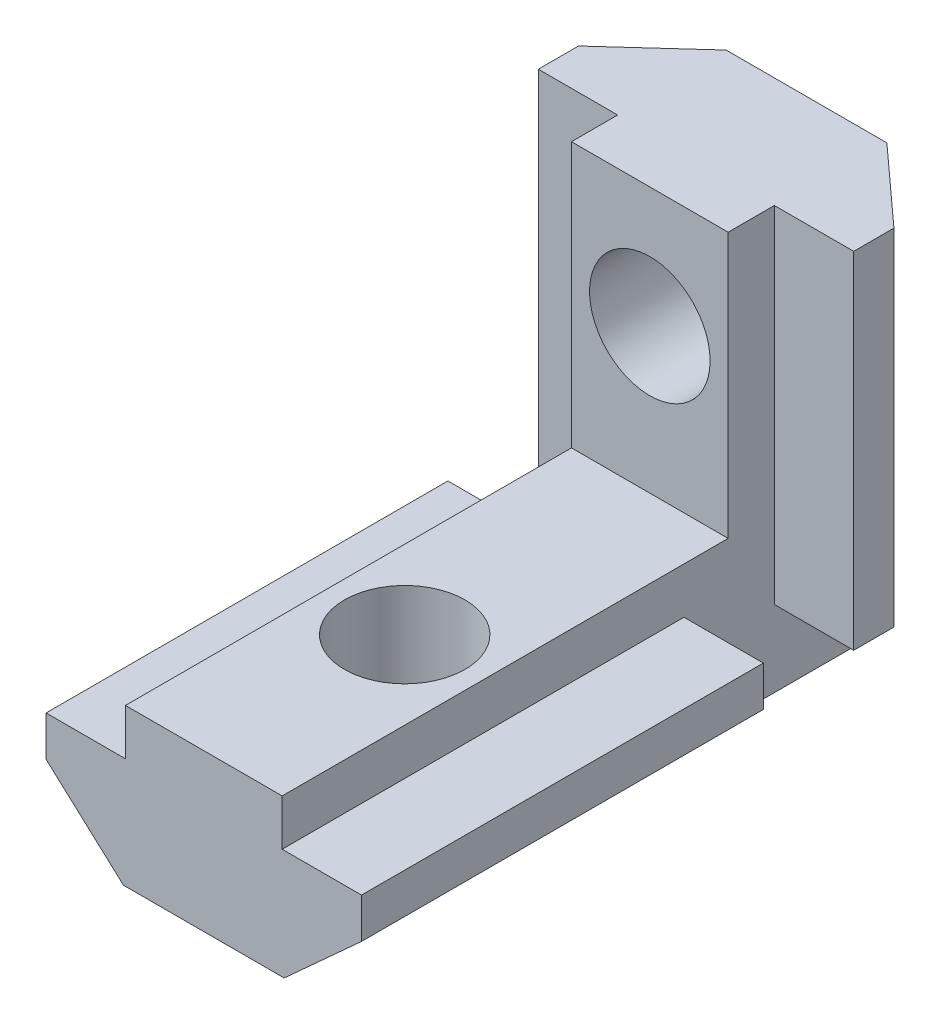
ISO-10303-21;
HEADER;
FILE_DESCRIPTION(('STEP AP214'),'2;1');
FILE_NAME('part.step','',(''),(''),'','','');
FILE_SCHEMA(('AUTOMOTIVE_DESIGN { 1 0 10303 214 1 1 1 1 }'));
ENDSEC;
DATA;
#1=APPLICATION_CONTEXT('core data for automotive mechanical design processes');
#2=APPLICATION_PROTOCOL_DEFINITION('international standard','automotive_design',2000,#1);
#3=PRODUCT_CONTEXT('',#1,'mechanical');
#4=PRODUCT('Part','Part','',(#3));
#5=PRODUCT_RELATED_PRODUCT_CATEGORY('part','',(#4));
#6=PRODUCT_DEFINITION_FORMATION('','',#4);
#7=PRODUCT_DEFINITION_CONTEXT('part definition',#1,'design');
#8=PRODUCT_DEFINITION('design','',#6,#7);
#9=PRODUCT_DEFINITION_SHAPE('','',#8);
#10=(LENGTH_UNIT() NAMED_UNIT(*) SI_UNIT(.MILLI.,.METRE.));
#11=(NAMED_UNIT(*) PLANE_ANGLE_UNIT() SI_UNIT($,.RADIAN.));
#12=(NAMED_UNIT(*) SI_UNIT($,.STERADIAN.) SOLID_ANGLE_UNIT());
#13=UNCERTAINTY_MEASURE_WITH_UNIT(LENGTH_MEASURE(1.E-05),#10,'distance_accuracy_value','');
#14=(GEOMETRIC_REPRESENTATION_CONTEXT(3) GLOBAL_UNCERTAINTY_ASSIGNED_CONTEXT((#13)) GLOBAL_UNIT_ASSIGNED_CONTEXT((#10,
#11,#12)) REPRESENTATION_CONTEXT('',''));
#15=CARTESIAN_POINT('',(0.,0.,0.));
#16=DIRECTION('',(0.,0.,1.));
#17=DIRECTION('',(1.,0.,0.));
#18=AXIS2_PLACEMENT_3D('',#15,#16,#17);
#19=CARTESIAN_POINT('',(0.,0.,-0.0001));
#20=DIRECTION('',(0.,0.,-1.));
#21=DIRECTION('',(-1.,0.,0.));
#22=AXIS2_PLACEMENT_3D('',#19,#20,#21);
#23=PLANE('',#22);
#24=DIRECTION('',(0.,-1.,0.));
#25=VECTOR('',#24,1.);
#26=CARTESIAN_POINT('',(3.9,-2.3,-0.0001));
#27=LINE('',#26,#25);
#28=CARTESIAN_POINT('',(3.9,3.20000000000001,-0.0001));
#29=VERTEX_POINT('',#28);
#30=CARTESIAN_POINT('',(3.9,-2.3,-0.0001));
#31=VERTEX_POINT('',#30);
#32=EDGE_CURVE('E47',#29,#31,#27,.T.);
#33=ORIENTED_EDGE('',*,*,#32,.F.);
#34=DIRECTION('',(-1.,0.,0.));
#35=VECTOR('',#34,1.);
#36=CARTESIAN_POINT('',(3.90000000000002,3.20000000000001,-0.0001));
#37=LINE('',#36,#35);
#38=CARTESIAN_POINT('',(7.84999999999999,3.20000000000001,-0.0001));
#39=VERTEX_POINT('',#38);
#40=EDGE_CURVE('E238',#39,#29,#37,.T.);
#41=ORIENTED_EDGE('',*,*,#40,.F.);
#42=DIRECTION('',(0.,1.,0.));
#43=VECTOR('',#42,1.);
#44=CARTESIAN_POINT('',(7.84999999999999,3.20000000000001,-0.0001));
#45=LINE('',#44,#43);
#46=CARTESIAN_POINT('',(7.84999999999999,1.20000000000002,-0.0001));
#47=VERTEX_POINT('',#46);
#48=EDGE_CURVE('E236',#47,#39,#45,.T.);
#49=ORIENTED_EDGE('',*,*,#48,.F.);
#50=DIRECTION('',(0.739940073395939,0.672672793996317,0.));
#51=VECTOR('',#50,1.);
#52=CARTESIAN_POINT('',(7.84999999999999,1.20000000000002,-0.0001));
#53=LINE('',#52,#51);
#54=CARTESIAN_POINT('',(4.00000000000003,-2.3,-0.0001));
#55=VERTEX_POINT('',#54);
#56=EDGE_CURVE('E233',#55,#47,#53,.T.);
#57=ORIENTED_EDGE('',*,*,#56,.F.);
#58=DIRECTION('',(1.,0.,0.));
#59=VECTOR('',#58,1.);
#60=CARTESIAN_POINT('',(4.00000000000003,-2.3,-0.0001));
#61=LINE('',#60,#59);
#62=EDGE_CURVE('E229',#31,#55,#61,.T.);
#63=ORIENTED_EDGE('',*,*,#62,.F.);
#64=EDGE_LOOP('',(#33,#41,#49,#57,#63));
#65=FACE_BOUND('',#64,.T.);
#66=ADVANCED_FACE('F38',(#65),#23,.T.);
#67=CARTESIAN_POINT('',(-3.90000000000002,8.31526264915494,-0.0001));
#68=DIRECTION('',(-1.,0.,0.));
#69=DIRECTION('',(0.,0.,1.));
#70=AXIS2_PLACEMENT_3D('',#67,#68,#69);
#71=PLANE('',#70);
#72=DIRECTION('',(0.,-1.,0.));
#73=VECTOR('',#72,1.);
#74=CARTESIAN_POINT('',(-3.90000000000002,8.31526264915494,20.));
#75=LINE('',#74,#73);
#76=CARTESIAN_POINT('',(-3.90000000000002,5.5,20.));
#77=VERTEX_POINT('',#76);
#78=CARTESIAN_POINT('',(-3.90000000000002,3.19999999999994,20.));
#79=VERTEX_POINT('',#78);
#80=EDGE_CURVE('E257',#77,#79,#75,.T.);
#81=ORIENTED_EDGE('',*,*,#80,.F.);
#82=DIRECTION('',(0.,0.,1.));
#83=VECTOR('',#82,1.);
#84=CARTESIAN_POINT('',(-3.9,5.5,-10.0001));
#85=LINE('',#84,#83);
#86=CARTESIAN_POINT('',(-3.9,5.5,-2.2001));
#87=VERTEX_POINT('',#86);
#88=EDGE_CURVE('E200',#87,#77,#85,.T.);
#89=ORIENTED_EDGE('',*,*,#88,.F.);
#90=DIRECTION('',(0.,1.,0.));
#91=VECTOR('',#90,1.);
#92=CARTESIAN_POINT('',(-3.9,1.5,-2.2001));
#93=LINE('',#92,#91);
#94=CARTESIAN_POINT('',(-3.9,18.7,-2.2001));
#95=VERTEX_POINT('',#94);
#96=EDGE_CURVE('E334',#87,#95,#93,.T.);
#97=ORIENTED_EDGE('',*,*,#96,.T.);
#98=DIRECTION('',(0.,0.,1.));
#99=VECTOR('',#98,1.);
#100=CARTESIAN_POINT('',(-3.9,18.7,-2.2001));
#101=LINE('',#100,#99);
#102=CARTESIAN_POINT('',(-3.9,18.7,-4.5001));
#103=VERTEX_POINT('',#102);
#104=EDGE_CURVE('E376',#103,#95,#101,.T.);
#105=ORIENTED_EDGE('',*,*,#104,.F.);
#106=DIRECTION('',(0.,1.,0.));
#107=VECTOR('',#106,1.);
#108=CARTESIAN_POINT('',(-3.9,1.5,-4.5001));
#109=LINE('',#108,#107);
#110=CARTESIAN_POINT('',(-3.9,1.5,-4.5001));
#111=VERTEX_POINT('',#110);
#112=EDGE_CURVE('E351',#111,#103,#109,.T.);
#113=ORIENTED_EDGE('',*,*,#112,.F.);
#114=DIRECTION('',(0.,0.,1.));
#115=VECTOR('',#114,1.);
#116=CARTESIAN_POINT('',(-3.90000000000002,1.5,-0.0001));
#117=LINE('',#116,#115);
#118=CARTESIAN_POINT('',(-3.9,1.5,-10.0001));
#119=VERTEX_POINT('',#118);
#120=EDGE_CURVE('E311',#119,#111,#117,.T.);
#121=ORIENTED_EDGE('',*,*,#120,.F.);
#122=DIRECTION('',(0.,1.,0.));
#123=VECTOR('',#122,1.);
#124=CARTESIAN_POINT('',(-3.9,5.5,-10.0001));
#125=LINE('',#124,#123);
#126=CARTESIAN_POINT('',(-3.9,-2.3,-10.0001));
#127=VERTEX_POINT('',#126);
#128=EDGE_CURVE('E313',#127,#119,#125,.T.);
#129=ORIENTED_EDGE('',*,*,#128,.F.);
#130=DIRECTION('',(0.,0.,1.));
#131=VECTOR('',#130,1.);
#132=CARTESIAN_POINT('',(-3.9,-2.3,-10.0001));
#133=LINE('',#132,#131);
#134=CARTESIAN_POINT('',(-3.9,-2.3,-0.0001));
#135=VERTEX_POINT('',#134);
#136=EDGE_CURVE('E271',#127,#135,#133,.T.);
#137=ORIENTED_EDGE('',*,*,#136,.T.);
#138=DIRECTION('',(0.,1.,0.));
#139=VECTOR('',#138,1.);
#140=CARTESIAN_POINT('',(-3.9,5.5,-0.0001));
#141=LINE('',#140,#139);
#142=CARTESIAN_POINT('',(-3.90000000000002,3.19999999999994,-0.0001));
#143=VERTEX_POINT('',#142);
#144=EDGE_CURVE('E259',#135,#143,#141,.T.);
#145=ORIENTED_EDGE('',*,*,#144,.T.);
#146=DIRECTION('',(0.,0.,1.));
#147=VECTOR('',#146,1.);
#148=CARTESIAN_POINT('',(-3.90000000000002,3.19999999999994,-0.0001));
#149=LINE('',#148,#147);
#150=EDGE_CURVE('E240',#143,#79,#149,.T.);
#151=ORIENTED_EDGE('',*,*,#150,.T.);
#152=EDGE_LOOP('',(#81,#89,#97,#105,#113,#121,#129,#137,#145,#151));
#153=FACE_BOUND('',#152,.T.);
#154=ADVANCED_FACE('F40',(#153),#71,.T.);
#155=CARTESIAN_POINT('',(3.90000000000002,8.31526264915495,-0.0001));
#156=DIRECTION('',(1.,0.,0.));
#157=DIRECTION('',(0.,0.,-1.));
#158=AXIS2_PLACEMENT_3D('',#155,#156,#157);
#159=PLANE('',#158);
#160=DIRECTION('',(0.,0.,1.));
#161=VECTOR('',#160,1.);
#162=CARTESIAN_POINT('',(3.9,5.5,-10.0001));
#163=LINE('',#162,#161);
#164=CARTESIAN_POINT('',(3.9,5.5,-2.2001));
#165=VERTEX_POINT('',#164);
#166=CARTESIAN_POINT('',(3.9,5.5,20.));
#167=VERTEX_POINT('',#166);
#168=EDGE_CURVE('E191',#165,#167,#163,.T.);
#169=ORIENTED_EDGE('',*,*,#168,.T.);
#170=DIRECTION('',(0.,1.,0.));
#171=VECTOR('',#170,1.);
#172=CARTESIAN_POINT('',(3.90000000000002,8.31526264915495,20.));
#173=LINE('',#172,#171);
#174=CARTESIAN_POINT('',(3.90000000000002,3.20000000000001,20.));
#175=VERTEX_POINT('',#174);
#176=EDGE_CURVE('E196',#175,#167,#173,.T.);
#177=ORIENTED_EDGE('',*,*,#176,.F.);
#178=DIRECTION('',(0.,0.,1.));
#179=VECTOR('',#178,1.);
#180=CARTESIAN_POINT('',(3.90000000000002,3.20000000000001,-0.0001));
#181=LINE('',#180,#179);
#182=EDGE_CURVE('E241',#29,#175,#181,.T.);
#183=ORIENTED_EDGE('',*,*,#182,.F.);
#184=ORIENTED_EDGE('',*,*,#32,.T.);
#185=DIRECTION('',(0.,0.,1.));
#186=VECTOR('',#185,1.);
#187=CARTESIAN_POINT('',(3.9,-2.3,-10.0001));
#188=LINE('',#187,#186);
#189=CARTESIAN_POINT('',(3.9,-2.3,-10.0001));
#190=VERTEX_POINT('',#189);
#191=EDGE_CURVE('E201',#190,#31,#188,.T.);
#192=ORIENTED_EDGE('',*,*,#191,.F.);
#193=DIRECTION('',(0.,-1.,0.));
#194=VECTOR('',#193,1.);
#195=CARTESIAN_POINT('',(3.9,-2.3,-10.0001));
#196=LINE('',#195,#194);
#197=CARTESIAN_POINT('',(3.9,1.5,-10.0001));
#198=VERTEX_POINT('',#197);
#199=EDGE_CURVE('E297',#198,#190,#196,.T.);
#200=ORIENTED_EDGE('',*,*,#199,.F.);
#201=DIRECTION('',(0.,0.,-1.));
#202=VECTOR('',#201,1.);
#203=CARTESIAN_POINT('',(3.90000000000002,1.5,-0.0001));
#204=LINE('',#203,#202);
#205=CARTESIAN_POINT('',(3.9,1.5,-4.5001));
#206=VERTEX_POINT('',#205);
#207=EDGE_CURVE('E315',#206,#198,#204,.T.);
#208=ORIENTED_EDGE('',*,*,#207,.F.);
#209=DIRECTION('',(0.,1.,0.));
#210=VECTOR('',#209,1.);
#211=CARTESIAN_POINT('',(3.9,1.5,-4.5001));
#212=LINE('',#211,#210);
#213=CARTESIAN_POINT('',(3.9,18.7,-4.5001));
#214=VERTEX_POINT('',#213);
#215=EDGE_CURVE('E329',#206,#214,#212,.T.);
#216=ORIENTED_EDGE('',*,*,#215,.T.);
#217=DIRECTION('',(0.,0.,-1.));
#218=VECTOR('',#217,1.);
#219=CARTESIAN_POINT('',(3.9,18.7,-2.2001));
#220=LINE('',#219,#218);
#221=CARTESIAN_POINT('',(3.9,18.7,-2.2001));
#222=VERTEX_POINT('',#221);
#223=EDGE_CURVE('E400',#222,#214,#220,.T.);
#224=ORIENTED_EDGE('',*,*,#223,.F.);
#225=DIRECTION('',(0.,1.,0.));
#226=VECTOR('',#225,1.);
#227=CARTESIAN_POINT('',(3.9,1.5,-2.2001));
#228=LINE('',#227,#226);
#229=EDGE_CURVE('E198',#165,#222,#228,.T.);
#230=ORIENTED_EDGE('',*,*,#229,.F.);
#231=EDGE_LOOP('',(#169,#177,#183,#184,#192,#200,#208,#216,#224,#230));
#232=FACE_BOUND('',#231,.T.);
#233=ADVANCED_FACE('F193',(#232),#159,.T.);
#234=CARTESIAN_POINT('',(3.90000000000002,3.20000000000001,-0.0001));
#235=DIRECTION('',(0.,1.,0.));
#236=DIRECTION('',(0.,0.,1.));
#237=AXIS2_PLACEMENT_3D('',#234,#235,#236);
#238=PLANE('',#237);
#239=ORIENTED_EDGE('',*,*,#182,.T.);
#240=DIRECTION('',(-1.,0.,0.));
#241=VECTOR('',#240,1.);
#242=CARTESIAN_POINT('',(3.90000000000002,3.20000000000001,20.));
#243=LINE('',#242,#241);
#244=CARTESIAN_POINT('',(7.84999999999999,3.20000000000001,20.));
#245=VERTEX_POINT('',#244);
#246=EDGE_CURVE('E214',#245,#175,#243,.T.);
#247=ORIENTED_EDGE('',*,*,#246,.F.);
#248=DIRECTION('',(0.,0.,1.));
#249=VECTOR('',#248,1.);
#250=CARTESIAN_POINT('',(7.84999999999999,3.20000000000001,-0.0001));
#251=LINE('',#250,#249);
#252=EDGE_CURVE('E54',#39,#245,#251,.T.);
#253=ORIENTED_EDGE('',*,*,#252,.F.);
#254=ORIENTED_EDGE('',*,*,#40,.T.);
#255=EDGE_LOOP('',(#239,#247,#253,#254));
#256=FACE_BOUND('',#255,.T.);
#257=ADVANCED_FACE('F283',(#256),#238,.T.);
#258=CARTESIAN_POINT('',(7.84999999999999,3.20000000000001,-0.0001));
#259=DIRECTION('',(1.,0.,0.));
#260=DIRECTION('',(0.,0.,-1.));
#261=AXIS2_PLACEMENT_3D('',#258,#259,#260);
#262=PLANE('',#261);
#263=ORIENTED_EDGE('',*,*,#252,.T.);
#264=DIRECTION('',(0.,1.,0.));
#265=VECTOR('',#264,1.);
#266=CARTESIAN_POINT('',(7.84999999999999,3.20000000000001,20.));
#267=LINE('',#266,#265);
#268=CARTESIAN_POINT('',(7.84999999999999,1.20000000000002,20.));
#269=VERTEX_POINT('',#268);
#270=EDGE_CURVE('E220',#269,#245,#267,.T.);
#271=ORIENTED_EDGE('',*,*,#270,.F.);
#272=DIRECTION('',(0.,0.,1.));
#273=VECTOR('',#272,1.);
#274=CARTESIAN_POINT('',(7.84999999999999,1.20000000000002,-0.0001));
#275=LINE('',#274,#273);
#276=EDGE_CURVE('E62',#47,#269,#275,.T.);
#277=ORIENTED_EDGE('',*,*,#276,.F.);
#278=ORIENTED_EDGE('',*,*,#48,.T.);
#279=EDGE_LOOP('',(#263,#271,#277,#278));
#280=FACE_BOUND('',#279,.T.);
#281=ADVANCED_FACE('F491',(#280),#262,.T.);
#282=CARTESIAN_POINT('',(7.84999999999999,1.20000000000002,-0.0001));
#283=DIRECTION('',(0.672672793996317,-0.739940073395939,0.));
#284=DIRECTION('',(0.739940073395939,0.672672793996317,0.));
#285=AXIS2_PLACEMENT_3D('',#282,#283,#284);
#286=PLANE('',#285);
#287=ORIENTED_EDGE('',*,*,#276,.T.);
#288=DIRECTION('',(0.739940073395939,0.672672793996317,0.));
#289=VECTOR('',#288,1.);
#290=CARTESIAN_POINT('',(7.84999999999999,1.20000000000002,20.));
#291=LINE('',#290,#289);
#292=CARTESIAN_POINT('',(4.00000000000003,-2.3,20.));
#293=VERTEX_POINT('',#292);
#294=EDGE_CURVE('E280',#293,#269,#291,.T.);
#295=ORIENTED_EDGE('',*,*,#294,.F.);
#296=DIRECTION('',(0.,0.,1.));
#297=VECTOR('',#296,1.);
#298=CARTESIAN_POINT('',(4.00000000000003,-2.3,-0.0001));
#299=LINE('',#298,#297);
#300=EDGE_CURVE('E245',#55,#293,#299,.T.);
#301=ORIENTED_EDGE('',*,*,#300,.F.);
#302=ORIENTED_EDGE('',*,*,#56,.T.);
#303=EDGE_LOOP('',(#287,#295,#301,#302));
#304=FACE_BOUND('',#303,.T.);
#305=ADVANCED_FACE('F301',(#304),#286,.T.);
#306=CARTESIAN_POINT('',(4.00000000000003,-2.3,-0.0001));
#307=DIRECTION('',(0.,-1.,0.));
#308=DIRECTION('',(1.,0.,0.));
#309=AXIS2_PLACEMENT_3D('',#306,#307,#308);
#310=PLANE('',#309);
#311=CARTESIAN_POINT('',(0.,-2.3,10.));
#312=DIRECTION('',(0.,1.,0.));
#313=DIRECTION('',(-1.,0.,0.));
#314=AXIS2_PLACEMENT_3D('',#311,#312,#313);
#315=CIRCLE('',#314,3.);
#316=CARTESIAN_POINT('',(-3.,-2.3,10.));
#317=VERTEX_POINT('',#316);
#318=EDGE_CURVE('E403',#317,#317,#315,.T.);
#319=ORIENTED_EDGE('',*,*,#318,.T.);
#320=EDGE_LOOP('',(#319));
#321=FACE_BOUND('',#320,.T.);
#322=ORIENTED_EDGE('',*,*,#300,.T.);
#323=DIRECTION('',(1.,0.,0.));
#324=VECTOR('',#323,1.);
#325=CARTESIAN_POINT('',(4.00000000000003,-2.3,20.));
#326=LINE('',#325,#324);
#327=CARTESIAN_POINT('',(-4.00000000000003,-2.3,20.));
#328=VERTEX_POINT('',#327);
#329=EDGE_CURVE('E277',#328,#293,#326,.T.);
#330=ORIENTED_EDGE('',*,*,#329,.F.);
#331=DIRECTION('',(0.,0.,1.));
#332=VECTOR('',#331,1.);
#333=CARTESIAN_POINT('',(-4.00000000000003,-2.3,-0.0001));
#334=LINE('',#333,#332);
#335=CARTESIAN_POINT('',(-4.00000000000003,-2.3,-0.0001));
#336=VERTEX_POINT('',#335);
#337=EDGE_CURVE('E247',#336,#328,#334,.T.);
#338=ORIENTED_EDGE('',*,*,#337,.F.);
#339=EDGE_CURVE('E230',#336,#135,#61,.T.);
#340=ORIENTED_EDGE('',*,*,#339,.T.);
#341=ORIENTED_EDGE('',*,*,#136,.F.);
#342=DIRECTION('',(-1.,0.,0.));
#343=VECTOR('',#342,1.);
#344=CARTESIAN_POINT('',(-3.9,-2.3,-10.0001));
#345=LINE('',#344,#343);
#346=EDGE_CURVE('E296',#190,#127,#345,.T.);
#347=ORIENTED_EDGE('',*,*,#346,.F.);
#348=ORIENTED_EDGE('',*,*,#191,.T.);
#349=ORIENTED_EDGE('',*,*,#62,.T.);
#350=EDGE_LOOP('',(#322,#330,#338,#340,#341,#347,#348,#349));
#351=FACE_BOUND('',#350,.T.);
#352=ADVANCED_FACE('F292',(#321,#351),#310,.T.);
#353=CARTESIAN_POINT('',(-7.84999999999999,1.19999999999994,-0.0001));
#354=DIRECTION('',(-0.672672793996309,-0.739940073395947,0.));
#355=DIRECTION('',(0.739940073395947,-0.672672793996309,0.));
#356=AXIS2_PLACEMENT_3D('',#353,#354,#355);
#357=PLANE('',#356);
#358=ORIENTED_EDGE('',*,*,#337,.T.);
#359=DIRECTION('',(0.739940073395947,-0.672672793996309,0.));
#360=VECTOR('',#359,1.);
#361=CARTESIAN_POINT('',(-7.84999999999999,1.19999999999994,20.));
#362=LINE('',#361,#360);
#363=CARTESIAN_POINT('',(-7.84999999999999,1.19999999999994,20.));
#364=VERTEX_POINT('',#363);
#365=EDGE_CURVE('E269',#364,#328,#362,.T.);
#366=ORIENTED_EDGE('',*,*,#365,.F.);
#367=DIRECTION('',(0.,0.,1.));
#368=VECTOR('',#367,1.);
#369=CARTESIAN_POINT('',(-7.84999999999999,1.19999999999994,-0.0001));
#370=LINE('',#369,#368);
#371=CARTESIAN_POINT('',(-7.84999999999999,1.19999999999994,-0.0001));
#372=VERTEX_POINT('',#371);
#373=EDGE_CURVE('E249',#372,#364,#370,.T.);
#374=ORIENTED_EDGE('',*,*,#373,.F.);
#375=DIRECTION('',(0.739940073395947,-0.672672793996309,0.));
#376=VECTOR('',#375,1.);
#377=CARTESIAN_POINT('',(-7.84999999999999,1.19999999999994,-0.0001));
#378=LINE('',#377,#376);
#379=EDGE_CURVE('E226',#372,#336,#378,.T.);
#380=ORIENTED_EDGE('',*,*,#379,.T.);
#381=EDGE_LOOP('',(#358,#366,#374,#380));
#382=FACE_BOUND('',#381,.T.);
#383=ADVANCED_FACE('F305',(#382),#357,.T.);
#384=CARTESIAN_POINT('',(-7.84999999999999,3.19999999999994,-0.0001));
#385=DIRECTION('',(-1.,0.,0.));
#386=DIRECTION('',(0.,0.,1.));
#387=AXIS2_PLACEMENT_3D('',#384,#385,#386);
#388=PLANE('',#387);
#389=ORIENTED_EDGE('',*,*,#373,.T.);
#390=DIRECTION('',(0.,-1.,0.));
#391=VECTOR('',#390,1.);
#392=CARTESIAN_POINT('',(-7.84999999999999,3.19999999999994,20.));
#393=LINE('',#392,#391);
#394=CARTESIAN_POINT('',(-7.84999999999999,3.19999999999994,20.));
#395=VERTEX_POINT('',#394);
#396=EDGE_CURVE('E267',#395,#364,#393,.T.);
#397=ORIENTED_EDGE('',*,*,#396,.F.);
#398=DIRECTION('',(0.,0.,1.));
#399=VECTOR('',#398,1.);
#400=CARTESIAN_POINT('',(-7.84999999999999,3.19999999999994,-0.0001));
#401=LINE('',#400,#399);
#402=CARTESIAN_POINT('',(-7.84999999999999,3.19999999999994,-0.0001));
#403=VERTEX_POINT('',#402);
#404=EDGE_CURVE('E251',#403,#395,#401,.T.);
#405=ORIENTED_EDGE('',*,*,#404,.F.);
#406=DIRECTION('',(0.,-1.,0.));
#407=VECTOR('',#406,1.);
#408=CARTESIAN_POINT('',(-7.84999999999999,3.19999999999994,-0.0001));
#409=LINE('',#408,#407);
#410=EDGE_CURVE('E218',#403,#372,#409,.T.);
#411=ORIENTED_EDGE('',*,*,#410,.T.);
#412=EDGE_LOOP('',(#389,#397,#405,#411));
#413=FACE_BOUND('',#412,.T.);
#414=ADVANCED_FACE('F477',(#413),#388,.T.);
#415=CARTESIAN_POINT('',(-3.90000000000002,3.19999999999994,-0.0001));
#416=DIRECTION('',(0.,1.,0.));
#417=DIRECTION('',(0.,0.,1.));
#418=AXIS2_PLACEMENT_3D('',#415,#416,#417);
#419=PLANE('',#418);
#420=ORIENTED_EDGE('',*,*,#404,.T.);
#421=DIRECTION('',(-1.,0.,0.));
#422=VECTOR('',#421,1.);
#423=CARTESIAN_POINT('',(-3.90000000000002,3.19999999999994,20.));
#424=LINE('',#423,#422);
#425=EDGE_CURVE('E263',#79,#395,#424,.T.);
#426=ORIENTED_EDGE('',*,*,#425,.F.);
#427=ORIENTED_EDGE('',*,*,#150,.F.);
#428=DIRECTION('',(-1.,0.,0.));
#429=VECTOR('',#428,1.);
#430=CARTESIAN_POINT('',(-3.90000000000002,3.19999999999994,-0.0001));
#431=LINE('',#430,#429);
#432=EDGE_CURVE('E215',#143,#403,#431,.T.);
#433=ORIENTED_EDGE('',*,*,#432,.T.);
#434=EDGE_LOOP('',(#420,#426,#427,#433));
#435=FACE_BOUND('',#434,.T.);
#436=ADVANCED_FACE('F264',(#435),#419,.T.);
#437=ORIENTED_EDGE('',*,*,#144,.F.);
#438=ORIENTED_EDGE('',*,*,#339,.F.);
#439=ORIENTED_EDGE('',*,*,#379,.F.);
#440=ORIENTED_EDGE('',*,*,#410,.F.);
#441=ORIENTED_EDGE('',*,*,#432,.F.);
#442=EDGE_LOOP('',(#437,#438,#439,#440,#441));
#443=FACE_BOUND('',#442,.T.);
#444=ADVANCED_FACE('F309',(#443),#23,.T.);
#445=CARTESIAN_POINT('',(0.,0.,20.));
#446=DIRECTION('',(0.,0.,-1.));
#447=DIRECTION('',(-1.,0.,0.));
#448=AXIS2_PLACEMENT_3D('',#445,#446,#447);
#449=PLANE('',#448);
#450=ORIENTED_EDGE('',*,*,#176,.T.);
#451=DIRECTION('',(-1.,0.,0.));
#452=VECTOR('',#451,1.);
#453=CARTESIAN_POINT('',(-3.90000000000002,5.5,20.));
#454=LINE('',#453,#452);
#455=EDGE_CURVE('E204',#167,#77,#454,.T.);
#456=ORIENTED_EDGE('',*,*,#455,.T.);
#457=ORIENTED_EDGE('',*,*,#80,.T.);
#458=ORIENTED_EDGE('',*,*,#425,.T.);
#459=ORIENTED_EDGE('',*,*,#396,.T.);
#460=ORIENTED_EDGE('',*,*,#365,.T.);
#461=ORIENTED_EDGE('',*,*,#329,.T.);
#462=ORIENTED_EDGE('',*,*,#294,.T.);
#463=ORIENTED_EDGE('',*,*,#270,.T.);
#464=ORIENTED_EDGE('',*,*,#246,.T.);
#465=EDGE_LOOP('',(#450,#456,#457,#458,#459,#460,#461,#462,#463,#464));
#466=FACE_BOUND('',#465,.T.);
#467=ADVANCED_FACE('F212',(#466),#449,.F.);
#468=CARTESIAN_POINT('',(3.9,5.5,-10.0001));
#469=DIRECTION('',(0.,-1.,0.));
#470=DIRECTION('',(0.,0.,-1.));
#471=AXIS2_PLACEMENT_3D('',#468,#469,#470);
#472=PLANE('',#471);
#473=ORIENTED_EDGE('',*,*,#168,.F.);
#474=DIRECTION('',(-1.,0.,0.));
#475=VECTOR('',#474,1.);
#476=CARTESIAN_POINT('',(3.9,5.5,-2.2001));
#477=LINE('',#476,#475);
#478=EDGE_CURVE('E11',#165,#87,#477,.T.);
#479=ORIENTED_EDGE('',*,*,#478,.T.);
#480=ORIENTED_EDGE('',*,*,#88,.T.);
#481=ORIENTED_EDGE('',*,*,#455,.F.);
#482=EDGE_LOOP('',(#473,#479,#480,#481));
#483=FACE_BOUND('',#482,.T.);
#484=CARTESIAN_POINT('',(0.,5.5,10.));
#485=DIRECTION('',(0.,-1.,0.));
#486=DIRECTION('',(0.,0.,-1.));
#487=AXIS2_PLACEMENT_3D('',#484,#485,#486);
#488=CIRCLE('',#487,3.);
#489=CARTESIAN_POINT('',(0.,5.5,7.));
#490=VERTEX_POINT('',#489);
#491=EDGE_CURVE('E42',#490,#490,#488,.F.);
#492=ORIENTED_EDGE('',*,*,#491,.F.);
#493=EDGE_LOOP('',(#492));
#494=FACE_BOUND('',#493,.T.);
#495=ADVANCED_FACE('F205',(#483,#494),#472,.F.);
#496=CARTESIAN_POINT('',(0.,0.,-10.0001));
#497=DIRECTION('',(0.,0.,1.));
#498=DIRECTION('',(1.,0.,0.));
#499=AXIS2_PLACEMENT_3D('',#496,#497,#498);
#500=PLANE('',#499);
#501=CARTESIAN_POINT('',(0.,12.7,-10.0001));
#502=DIRECTION('',(0.,0.,1.));
#503=DIRECTION('',(1.,0.,0.));
#504=AXIS2_PLACEMENT_3D('',#501,#502,#503);
#505=CIRCLE('',#504,3.);
#506=CARTESIAN_POINT('',(3.,12.7,-10.0001));
#507=VERTEX_POINT('',#506);
#508=EDGE_CURVE('E406',#507,#507,#505,.T.);
#509=ORIENTED_EDGE('',*,*,#508,.T.);
#510=EDGE_LOOP('',(#509));
#511=FACE_BOUND('',#510,.T.);
#512=DIRECTION('',(-1.,0.,0.));
#513=VECTOR('',#512,1.);
#514=CARTESIAN_POINT('',(-4.,1.5,-10.0001));
#515=LINE('',#514,#513);
#516=CARTESIAN_POINT('',(4.,1.5,-10.0001));
#517=VERTEX_POINT('',#516);
#518=EDGE_CURVE('E327',#517,#198,#515,.T.);
#519=ORIENTED_EDGE('',*,*,#518,.T.);
#520=ORIENTED_EDGE('',*,*,#199,.T.);
#521=ORIENTED_EDGE('',*,*,#346,.T.);
#522=ORIENTED_EDGE('',*,*,#128,.T.);
#523=CARTESIAN_POINT('',(-4.,1.5,-10.0001));
#524=VERTEX_POINT('',#523);
#525=EDGE_CURVE('E363',#119,#524,#515,.T.);
#526=ORIENTED_EDGE('',*,*,#525,.T.);
#527=DIRECTION('',(0.,1.,0.));
#528=VECTOR('',#527,1.);
#529=CARTESIAN_POINT('',(-4.,1.5,-10.0001));
#530=LINE('',#529,#528);
#531=CARTESIAN_POINT('',(-4.,18.7,-10.0001));
#532=VERTEX_POINT('',#531);
#533=EDGE_CURVE('E345',#524,#532,#530,.T.);
#534=ORIENTED_EDGE('',*,*,#533,.T.);
#535=DIRECTION('',(-1.,0.,0.));
#536=VECTOR('',#535,1.);
#537=CARTESIAN_POINT('',(-4.,18.7,-10.0001));
#538=LINE('',#537,#536);
#539=CARTESIAN_POINT('',(4.,18.7,-10.0001));
#540=VERTEX_POINT('',#539);
#541=EDGE_CURVE('E388',#540,#532,#538,.T.);
#542=ORIENTED_EDGE('',*,*,#541,.F.);
#543=DIRECTION('',(0.,1.,0.));
#544=VECTOR('',#543,1.);
#545=CARTESIAN_POINT('',(4.,1.5,-10.0001));
#546=LINE('',#545,#544);
#547=EDGE_CURVE('E343',#517,#540,#546,.T.);
#548=ORIENTED_EDGE('',*,*,#547,.F.);
#549=EDGE_LOOP('',(#519,#520,#521,#522,#526,#534,#542,#548));
#550=FACE_BOUND('',#549,.T.);
#551=ADVANCED_FACE('F325',(#511,#550),#500,.F.);
#552=CARTESIAN_POINT('',(3.9,1.5,-2.2001));
#553=DIRECTION('',(0.,0.,1.));
#554=DIRECTION('',(1.,0.,0.));
#555=AXIS2_PLACEMENT_3D('',#552,#553,#554);
#556=PLANE('',#555);
#557=CARTESIAN_POINT('',(0.,12.7,-2.2001));
#558=DIRECTION('',(0.,0.,1.));
#559=DIRECTION('',(1.,0.,0.));
#560=AXIS2_PLACEMENT_3D('',#557,#558,#559);
#561=CIRCLE('',#560,3.);
#562=CARTESIAN_POINT('',(3.,12.7,-2.2001));
#563=VERTEX_POINT('',#562);
#564=EDGE_CURVE('E407',#563,#563,#561,.T.);
#565=ORIENTED_EDGE('',*,*,#564,.F.);
#566=EDGE_LOOP('',(#565));
#567=FACE_BOUND('',#566,.T.);
#568=ORIENTED_EDGE('',*,*,#478,.F.);
#569=ORIENTED_EDGE('',*,*,#229,.T.);
#570=DIRECTION('',(1.,0.,0.));
#571=VECTOR('',#570,1.);
#572=CARTESIAN_POINT('',(3.9,18.7,-2.2001));
#573=LINE('',#572,#571);
#574=EDGE_CURVE('E373',#95,#222,#573,.T.);
#575=ORIENTED_EDGE('',*,*,#574,.F.);
#576=ORIENTED_EDGE('',*,*,#96,.F.);
#577=EDGE_LOOP('',(#568,#569,#575,#576));
#578=FACE_BOUND('',#577,.T.);
#579=ADVANCED_FACE('F421',(#567,#578),#556,.T.);
#580=CARTESIAN_POINT('',(0.,1.5,0.));
#581=DIRECTION('',(0.,-1.,0.));
#582=DIRECTION('',(0.,0.,-1.));
#583=AXIS2_PLACEMENT_3D('',#580,#581,#582);
#584=PLANE('',#583);
#585=ORIENTED_EDGE('',*,*,#525,.F.);
#586=ORIENTED_EDGE('',*,*,#120,.T.);
#587=DIRECTION('',(1.,0.,0.));
#588=VECTOR('',#587,1.);
#589=CARTESIAN_POINT('',(-3.9,1.5,-4.5001));
#590=LINE('',#589,#588);
#591=CARTESIAN_POINT('',(-7.85,1.5,-4.5001));
#592=VERTEX_POINT('',#591);
#593=EDGE_CURVE('E339',#592,#111,#590,.T.);
#594=ORIENTED_EDGE('',*,*,#593,.F.);
#595=DIRECTION('',(0.,0.,1.));
#596=VECTOR('',#595,1.);
#597=CARTESIAN_POINT('',(-7.85,1.5,-4.5001));
#598=LINE('',#597,#596);
#599=CARTESIAN_POINT('',(-7.85,1.5,-6.5001));
#600=VERTEX_POINT('',#599);
#601=EDGE_CURVE('E356',#600,#592,#598,.T.);
#602=ORIENTED_EDGE('',*,*,#601,.F.);
#603=DIRECTION('',(-0.739940073395944,0.,0.672672793996312));
#604=VECTOR('',#603,1.);
#605=CARTESIAN_POINT('',(-7.85,1.5,-6.5001));
#606=LINE('',#605,#604);
#607=EDGE_CURVE('E359',#524,#600,#606,.T.);
#608=ORIENTED_EDGE('',*,*,#607,.F.);
#609=EDGE_LOOP('',(#585,#586,#594,#602,#608));
#610=FACE_BOUND('',#609,.T.);
#611=ADVANCED_FACE('F424',(#610),#584,.T.);
#612=CARTESIAN_POINT('',(-3.9,1.5,-4.5001));
#613=DIRECTION('',(0.,0.,1.));
#614=DIRECTION('',(1.,0.,0.));
#615=AXIS2_PLACEMENT_3D('',#612,#613,#614);
#616=PLANE('',#615);
#617=ORIENTED_EDGE('',*,*,#112,.T.);
#618=DIRECTION('',(1.,0.,0.));
#619=VECTOR('',#618,1.);
#620=CARTESIAN_POINT('',(-3.9,18.7,-4.5001));
#621=LINE('',#620,#619);
#622=CARTESIAN_POINT('',(-7.85,18.7,-4.5001));
#623=VERTEX_POINT('',#622);
#624=EDGE_CURVE('E379',#623,#103,#621,.T.);
#625=ORIENTED_EDGE('',*,*,#624,.F.);
#626=DIRECTION('',(0.,1.,0.));
#627=VECTOR('',#626,1.);
#628=CARTESIAN_POINT('',(-7.85,1.5,-4.5001));
#629=LINE('',#628,#627);
#630=EDGE_CURVE('E349',#592,#623,#629,.T.);
#631=ORIENTED_EDGE('',*,*,#630,.F.);
#632=ORIENTED_EDGE('',*,*,#593,.T.);
#633=EDGE_LOOP('',(#617,#625,#631,#632));
#634=FACE_BOUND('',#633,.T.);
#635=ADVANCED_FACE('F433',(#634),#616,.T.);
#636=CARTESIAN_POINT('',(-7.85,1.5,-4.5001));
#637=DIRECTION('',(-1.,0.,0.));
#638=DIRECTION('',(0.,0.,1.));
#639=AXIS2_PLACEMENT_3D('',#636,#637,#638);
#640=PLANE('',#639);
#641=ORIENTED_EDGE('',*,*,#630,.T.);
#642=DIRECTION('',(0.,0.,1.));
#643=VECTOR('',#642,1.);
#644=CARTESIAN_POINT('',(-7.85,18.7,-4.5001));
#645=LINE('',#644,#643);
#646=CARTESIAN_POINT('',(-7.85,18.7,-6.5001));
#647=VERTEX_POINT('',#646);
#648=EDGE_CURVE('E382',#647,#623,#645,.T.);
#649=ORIENTED_EDGE('',*,*,#648,.F.);
#650=DIRECTION('',(0.,1.,0.));
#651=VECTOR('',#650,1.);
#652=CARTESIAN_POINT('',(-7.85,1.5,-6.5001));
#653=LINE('',#652,#651);
#654=EDGE_CURVE('E347',#600,#647,#653,.T.);
#655=ORIENTED_EDGE('',*,*,#654,.F.);
#656=ORIENTED_EDGE('',*,*,#601,.T.);
#657=EDGE_LOOP('',(#641,#649,#655,#656));
#658=FACE_BOUND('',#657,.T.);
#659=ADVANCED_FACE('F439',(#658),#640,.T.);
#660=CARTESIAN_POINT('',(-7.85,1.5,-6.5001));
#661=DIRECTION('',(-0.672672793996313,0.,-0.739940073395944));
#662=DIRECTION('',(-0.739940073395944,0.,0.672672793996313));
#663=AXIS2_PLACEMENT_3D('',#660,#661,#662);
#664=PLANE('',#663);
#665=ORIENTED_EDGE('',*,*,#654,.T.);
#666=DIRECTION('',(-0.739940073395944,0.,0.672672793996312));
#667=VECTOR('',#666,1.);
#668=CARTESIAN_POINT('',(-7.85,18.7,-6.5001));
#669=LINE('',#668,#667);
#670=EDGE_CURVE('E385',#532,#647,#669,.T.);
#671=ORIENTED_EDGE('',*,*,#670,.F.);
#672=ORIENTED_EDGE('',*,*,#533,.F.);
#673=ORIENTED_EDGE('',*,*,#607,.T.);
#674=EDGE_LOOP('',(#665,#671,#672,#673));
#675=FACE_BOUND('',#674,.T.);
#676=ADVANCED_FACE('F442',(#675),#664,.T.);
#677=CARTESIAN_POINT('',(7.85,1.5,-6.5001));
#678=DIRECTION('',(0.672672793996313,0.,-0.739940073395944));
#679=DIRECTION('',(-0.739940073395944,0.,-0.672672793996313));
#680=AXIS2_PLACEMENT_3D('',#677,#678,#679);
#681=PLANE('',#680);
#682=ORIENTED_EDGE('',*,*,#547,.T.);
#683=DIRECTION('',(-0.739940073395944,0.,-0.672672793996312));
#684=VECTOR('',#683,1.);
#685=CARTESIAN_POINT('',(7.85,18.7,-6.5001));
#686=LINE('',#685,#684);
#687=CARTESIAN_POINT('',(7.85,18.7,-6.5001));
#688=VERTEX_POINT('',#687);
#689=EDGE_CURVE('E391',#688,#540,#686,.T.);
#690=ORIENTED_EDGE('',*,*,#689,.F.);
#691=DIRECTION('',(0.,1.,0.));
#692=VECTOR('',#691,1.);
#693=CARTESIAN_POINT('',(7.85,1.5,-6.5001));
#694=LINE('',#693,#692);
#695=CARTESIAN_POINT('',(7.85,1.5,-6.5001));
#696=VERTEX_POINT('',#695);
#697=EDGE_CURVE('E341',#696,#688,#694,.T.);
#698=ORIENTED_EDGE('',*,*,#697,.F.);
#699=DIRECTION('',(-0.739940073395944,0.,-0.672672793996312));
#700=VECTOR('',#699,1.);
#701=CARTESIAN_POINT('',(7.85,1.5,-6.5001));
#702=LINE('',#701,#700);
#703=EDGE_CURVE('E364',#696,#517,#702,.T.);
#704=ORIENTED_EDGE('',*,*,#703,.T.);
#705=EDGE_LOOP('',(#682,#690,#698,#704));
#706=FACE_BOUND('',#705,.T.);
#707=ADVANCED_FACE('F450',(#706),#681,.T.);
#708=CARTESIAN_POINT('',(7.85,1.5,-4.5001));
#709=DIRECTION('',(1.,0.,0.));
#710=DIRECTION('',(0.,0.,-1.));
#711=AXIS2_PLACEMENT_3D('',#708,#709,#710);
#712=PLANE('',#711);
#713=ORIENTED_EDGE('',*,*,#697,.T.);
#714=DIRECTION('',(0.,0.,-1.));
#715=VECTOR('',#714,1.);
#716=CARTESIAN_POINT('',(7.85,18.7,-4.5001));
#717=LINE('',#716,#715);
#718=CARTESIAN_POINT('',(7.85,18.7,-4.5001));
#719=VERTEX_POINT('',#718);
#720=EDGE_CURVE('E394',#719,#688,#717,.T.);
#721=ORIENTED_EDGE('',*,*,#720,.F.);
#722=DIRECTION('',(0.,1.,0.));
#723=VECTOR('',#722,1.);
#724=CARTESIAN_POINT('',(7.85,1.5,-4.5001));
#725=LINE('',#724,#723);
#726=CARTESIAN_POINT('',(7.85,1.5,-4.5001));
#727=VERTEX_POINT('',#726);
#728=EDGE_CURVE('E338',#727,#719,#725,.T.);
#729=ORIENTED_EDGE('',*,*,#728,.F.);
#730=DIRECTION('',(0.,0.,-1.));
#731=VECTOR('',#730,1.);
#732=CARTESIAN_POINT('',(7.85,1.5,-4.5001));
#733=LINE('',#732,#731);
#734=EDGE_CURVE('E367',#727,#696,#733,.T.);
#735=ORIENTED_EDGE('',*,*,#734,.T.);
#736=EDGE_LOOP('',(#713,#721,#729,#735));
#737=FACE_BOUND('',#736,.T.);
#738=ADVANCED_FACE('F453',(#737),#712,.T.);
#739=CARTESIAN_POINT('',(3.9,1.5,-4.5001));
#740=DIRECTION('',(0.,0.,1.));
#741=DIRECTION('',(1.,0.,0.));
#742=AXIS2_PLACEMENT_3D('',#739,#740,#741);
#743=PLANE('',#742);
#744=ORIENTED_EDGE('',*,*,#728,.T.);
#745=DIRECTION('',(1.,0.,0.));
#746=VECTOR('',#745,1.);
#747=CARTESIAN_POINT('',(3.9,18.7,-4.5001));
#748=LINE('',#747,#746);
#749=EDGE_CURVE('E397',#214,#719,#748,.T.);
#750=ORIENTED_EDGE('',*,*,#749,.F.);
#751=ORIENTED_EDGE('',*,*,#215,.F.);
#752=DIRECTION('',(1.,0.,0.));
#753=VECTOR('',#752,1.);
#754=CARTESIAN_POINT('',(3.9,1.5,-4.5001));
#755=LINE('',#754,#753);
#756=EDGE_CURVE('E370',#206,#727,#755,.T.);
#757=ORIENTED_EDGE('',*,*,#756,.T.);
#758=EDGE_LOOP('',(#744,#750,#751,#757));
#759=FACE_BOUND('',#758,.T.);
#760=ADVANCED_FACE('F455',(#759),#743,.T.);
#761=ORIENTED_EDGE('',*,*,#756,.F.);
#762=ORIENTED_EDGE('',*,*,#207,.T.);
#763=ORIENTED_EDGE('',*,*,#518,.F.);
#764=ORIENTED_EDGE('',*,*,#703,.F.);
#765=ORIENTED_EDGE('',*,*,#734,.F.);
#766=EDGE_LOOP('',(#761,#762,#763,#764,#765));
#767=FACE_BOUND('',#766,.T.);
#768=ADVANCED_FACE('F448',(#767),#584,.T.);
#769=CARTESIAN_POINT('',(0.,18.7,0.));
#770=DIRECTION('',(0.,-1.,0.));
#771=DIRECTION('',(0.,0.,-1.));
#772=AXIS2_PLACEMENT_3D('',#769,#770,#771);
#773=PLANE('',#772);
#774=ORIENTED_EDGE('',*,*,#223,.T.);
#775=ORIENTED_EDGE('',*,*,#749,.T.);
#776=ORIENTED_EDGE('',*,*,#720,.T.);
#777=ORIENTED_EDGE('',*,*,#689,.T.);
#778=ORIENTED_EDGE('',*,*,#541,.T.);
#779=ORIENTED_EDGE('',*,*,#670,.T.);
#780=ORIENTED_EDGE('',*,*,#648,.T.);
#781=ORIENTED_EDGE('',*,*,#624,.T.);
#782=ORIENTED_EDGE('',*,*,#104,.T.);
#783=ORIENTED_EDGE('',*,*,#574,.T.);
#784=EDGE_LOOP('',(#774,#775,#776,#777,#778,#779,#780,#781,#782,#783));
#785=FACE_BOUND('',#784,.T.);
#786=ADVANCED_FACE('F429',(#785),#773,.F.);
#787=CARTESIAN_POINT('',(0.,-2.3,10.));
#788=DIRECTION('',(0.,1.,0.));
#789=DIRECTION('',(-1.,0.,0.));
#790=AXIS2_PLACEMENT_3D('',#787,#788,#789);
#791=CYLINDRICAL_SURFACE('',#790,3.);
#792=ORIENTED_EDGE('',*,*,#491,.T.);
#793=EDGE_LOOP('',(#792));
#794=FACE_BOUND('',#793,.T.);
#795=ORIENTED_EDGE('',*,*,#318,.F.);
#796=EDGE_LOOP('',(#795));
#797=FACE_BOUND('',#796,.T.);
#798=ADVANCED_FACE('F417',(#794,#797),#791,.F.);
#799=CARTESIAN_POINT('',(0.,12.7,-10.0001));
#800=DIRECTION('',(0.,0.,1.));
#801=DIRECTION('',(1.,0.,0.));
#802=AXIS2_PLACEMENT_3D('',#799,#800,#801);
#803=CYLINDRICAL_SURFACE('',#802,3.);
#804=ORIENTED_EDGE('',*,*,#508,.F.);
#805=EDGE_LOOP('',(#804));
#806=FACE_BOUND('',#805,.T.);
#807=ORIENTED_EDGE('',*,*,#564,.T.);
#808=EDGE_LOOP('',(#807));
#809=FACE_BOUND('',#808,.T.);
#810=ADVANCED_FACE('F414',(#806,#809),#803,.F.);
#811=CLOSED_SHELL('',(#66,#154,#233,#257,#281,#305,#352,#383,#414,#436,#444,#467,#495,#551,#579,
#611,#635,#659,#676,#707,#738,#760,#768,#786,#798,#810));
#812=MANIFOLD_SOLID_BREP('B2',#811);
#813=ADVANCED_BREP_SHAPE_REPRESENTATION('',(#18,#812),#14);
#814=SHAPE_DEFINITION_REPRESENTATION(#9,#813);
ENDSEC;
END-ISO-10303-21;
